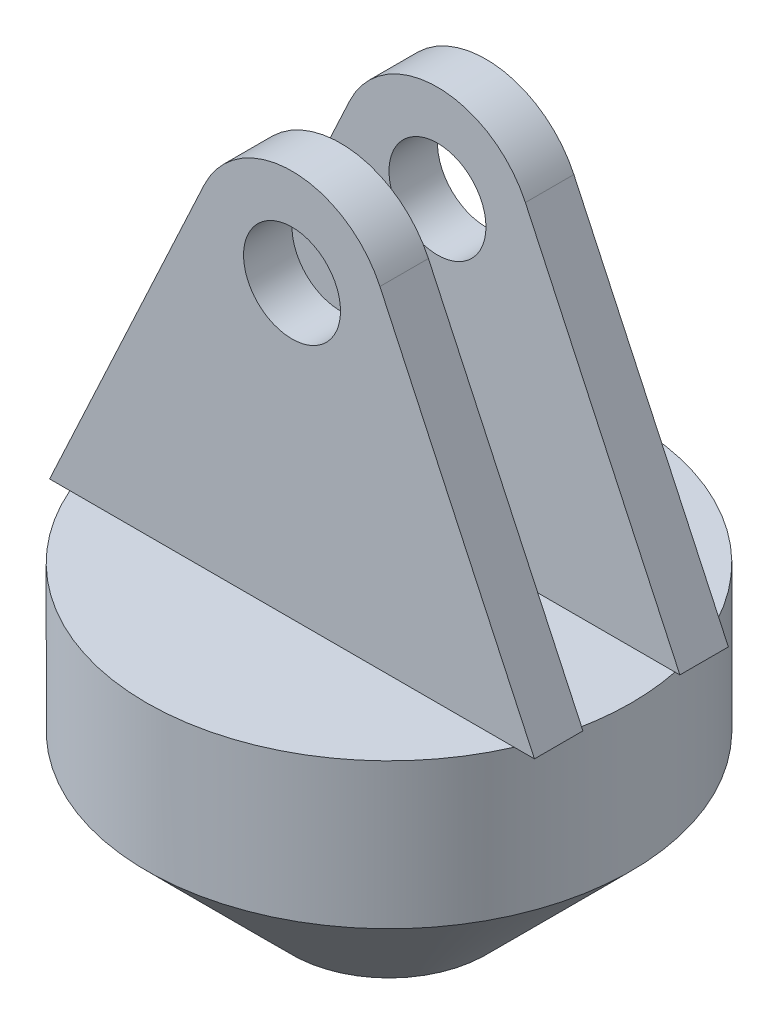
ISO-10303-21;
HEADER;
FILE_DESCRIPTION(('STEP AP214'),'2;1');
FILE_NAME('part.step','',(''),(''),'','','');
FILE_SCHEMA(('AUTOMOTIVE_DESIGN { 1 0 10303 214 1 1 1 1 }'));
ENDSEC;
DATA;
#1=APPLICATION_CONTEXT('core data for automotive mechanical design processes');
#2=APPLICATION_PROTOCOL_DEFINITION('international standard','automotive_design',2000,#1);
#3=PRODUCT_CONTEXT('',#1,'mechanical');
#4=PRODUCT('Part','Part','',(#3));
#5=PRODUCT_RELATED_PRODUCT_CATEGORY('part','',(#4));
#6=PRODUCT_DEFINITION_FORMATION('','',#4);
#7=PRODUCT_DEFINITION_CONTEXT('part definition',#1,'design');
#8=PRODUCT_DEFINITION('design','',#6,#7);
#9=PRODUCT_DEFINITION_SHAPE('','',#8);
#10=(LENGTH_UNIT() NAMED_UNIT(*) SI_UNIT(.MILLI.,.METRE.));
#11=(NAMED_UNIT(*) PLANE_ANGLE_UNIT() SI_UNIT($,.RADIAN.));
#12=(NAMED_UNIT(*) SI_UNIT($,.STERADIAN.) SOLID_ANGLE_UNIT());
#13=UNCERTAINTY_MEASURE_WITH_UNIT(LENGTH_MEASURE(1.E-05),#10,'distance_accuracy_value','');
#14=(GEOMETRIC_REPRESENTATION_CONTEXT(3) GLOBAL_UNCERTAINTY_ASSIGNED_CONTEXT((#13)) GLOBAL_UNIT_ASSIGNED_CONTEXT((#10,
#11,#12)) REPRESENTATION_CONTEXT('',''));
#15=CARTESIAN_POINT('',(0.,0.,0.));
#16=DIRECTION('',(0.,0.,1.));
#17=DIRECTION('',(1.,0.,0.));
#18=AXIS2_PLACEMENT_3D('',#15,#16,#17);
#19=CARTESIAN_POINT('',(50.,60.,0.));
#20=DIRECTION('',(0.,1.,0.));
#21=DIRECTION('',(0.,0.,1.));
#22=AXIS2_PLACEMENT_3D('',#19,#20,#21);
#23=PLANE('',#22);
#24=CARTESIAN_POINT('',(0.,60.,0.));
#25=DIRECTION('',(0.,-1.,0.));
#26=DIRECTION('',(0.,0.,-1.));
#27=AXIS2_PLACEMENT_3D('',#24,#25,#26);
#28=CIRCLE('',#27,50.);
#29=CARTESIAN_POINT('',(48.9897948556636,60.,-10.));
#30=VERTEX_POINT('',#29);
#31=CARTESIAN_POINT('',(48.9897948556636,60.,10.));
#32=VERTEX_POINT('',#31);
#33=EDGE_CURVE('E212',#30,#32,#28,.T.);
#34=ORIENTED_EDGE('',*,*,#33,.F.);
#35=DIRECTION('',(1.,0.,0.));
#36=VECTOR('',#35,1.);
#37=CARTESIAN_POINT('',(-50.,60.,-10.));
#38=LINE('',#37,#36);
#39=CARTESIAN_POINT('',(-48.9897948556636,60.,-10.));
#40=VERTEX_POINT('',#39);
#41=EDGE_CURVE('E54',#40,#30,#38,.T.);
#42=ORIENTED_EDGE('',*,*,#41,.F.);
#43=CARTESIAN_POINT('',(-48.9897948556636,60.,10.));
#44=VERTEX_POINT('',#43);
#45=EDGE_CURVE('E60',#44,#40,#28,.T.);
#46=ORIENTED_EDGE('',*,*,#45,.F.);
#47=DIRECTION('',(1.,0.,0.));
#48=VECTOR('',#47,1.);
#49=CARTESIAN_POINT('',(-50.,60.,10.));
#50=LINE('',#49,#48);
#51=EDGE_CURVE('E11',#44,#32,#50,.T.);
#52=ORIENTED_EDGE('',*,*,#51,.T.);
#53=EDGE_LOOP('',(#34,#42,#46,#52));
#54=FACE_BOUND('',#53,.T.);
#55=ADVANCED_FACE('F35',(#54),#23,.T.);
#56=DIRECTION('',(1.,0.,0.));
#57=VECTOR('',#56,1.);
#58=CARTESIAN_POINT('',(-50.,60.,-20.));
#59=LINE('',#58,#57);
#60=CARTESIAN_POINT('',(-45.8257569495584,60.,-20.));
#61=VERTEX_POINT('',#60);
#62=CARTESIAN_POINT('',(45.8257569495584,60.,-20.));
#63=VERTEX_POINT('',#62);
#64=EDGE_CURVE('E150',#61,#63,#59,.T.);
#65=ORIENTED_EDGE('',*,*,#64,.T.);
#66=EDGE_CURVE('E261',#61,#63,#28,.T.);
#67=ORIENTED_EDGE('',*,*,#66,.F.);
#68=EDGE_LOOP('',(#65,#67));
#69=FACE_BOUND('',#68,.T.);
#70=ADVANCED_FACE('F270',(#69),#23,.T.);
#71=CARTESIAN_POINT('',(0.,0.,0.));
#72=DIRECTION('',(0.,-1.,0.));
#73=DIRECTION('',(0.,0.,-1.));
#74=AXIS2_PLACEMENT_3D('',#71,#72,#73);
#75=PLANE('',#74);
#76=CARTESIAN_POINT('',(0.,0.,0.));
#77=DIRECTION('',(0.,-1.,0.));
#78=DIRECTION('',(0.,0.,-1.));
#79=AXIS2_PLACEMENT_3D('',#76,#77,#78);
#80=CIRCLE('',#79,20.);
#81=CARTESIAN_POINT('',(0.,0.,-20.));
#82=VERTEX_POINT('',#81);
#83=EDGE_CURVE('E39',#82,#82,#80,.T.);
#84=ORIENTED_EDGE('',*,*,#83,.T.);
#85=EDGE_LOOP('',(#84));
#86=FACE_BOUND('',#85,.T.);
#87=ADVANCED_FACE('F37',(#86),#75,.T.);
#88=CARTESIAN_POINT('',(0.,0.,0.));
#89=DIRECTION('',(0.,1.,0.));
#90=DIRECTION('',(0.,0.,1.));
#91=AXIS2_PLACEMENT_3D('',#88,#89,#90);
#92=CONICAL_SURFACE('',#91,20.,0.785398163397447);
#93=CARTESIAN_POINT('',(0.,30.0000000000001,0.));
#94=DIRECTION('',(0.,-1.,0.));
#95=DIRECTION('',(0.,0.,-1.));
#96=AXIS2_PLACEMENT_3D('',#93,#94,#95);
#97=CIRCLE('',#96,50.);
#98=CARTESIAN_POINT('',(0.,30.0000000000001,-50.));
#99=VERTEX_POINT('',#98);
#100=EDGE_CURVE('E214',#99,#99,#97,.T.);
#101=ORIENTED_EDGE('',*,*,#100,.T.);
#102=EDGE_LOOP('',(#101));
#103=FACE_BOUND('',#102,.T.);
#104=ORIENTED_EDGE('',*,*,#83,.F.);
#105=EDGE_LOOP('',(#104));
#106=FACE_BOUND('',#105,.T.);
#107=ADVANCED_FACE('F285',(#103,#106),#92,.T.);
#108=CARTESIAN_POINT('',(0.,0.,0.));
#109=DIRECTION('',(0.,-1.,0.));
#110=DIRECTION('',(0.,0.,-1.));
#111=AXIS2_PLACEMENT_3D('',#108,#109,#110);
#112=CYLINDRICAL_SURFACE('',#111,50.);
#113=CARTESIAN_POINT('',(45.8257569495584,60.,20.));
#114=VERTEX_POINT('',#113);
#115=EDGE_CURVE('E213',#32,#114,#28,.T.);
#116=ORIENTED_EDGE('',*,*,#115,.T.);
#117=CARTESIAN_POINT('',(-45.8257569495584,60.,20.));
#118=VERTEX_POINT('',#117);
#119=EDGE_CURVE('E215',#114,#118,#28,.T.);
#120=ORIENTED_EDGE('',*,*,#119,.T.);
#121=EDGE_CURVE('E256',#118,#44,#28,.T.);
#122=ORIENTED_EDGE('',*,*,#121,.T.);
#123=ORIENTED_EDGE('',*,*,#45,.T.);
#124=EDGE_CURVE('E259',#40,#61,#28,.T.);
#125=ORIENTED_EDGE('',*,*,#124,.T.);
#126=ORIENTED_EDGE('',*,*,#66,.T.);
#127=EDGE_CURVE('E263',#63,#30,#28,.T.);
#128=ORIENTED_EDGE('',*,*,#127,.T.);
#129=ORIENTED_EDGE('',*,*,#33,.T.);
#130=EDGE_LOOP('',(#116,#120,#122,#123,#125,#126,#128,#129));
#131=FACE_BOUND('',#130,.T.);
#132=ORIENTED_EDGE('',*,*,#100,.F.);
#133=EDGE_LOOP('',(#132));
#134=FACE_BOUND('',#133,.T.);
#135=ADVANCED_FACE('F266',(#131,#134),#112,.T.);
#136=DIRECTION('',(1.,0.,0.));
#137=VECTOR('',#136,1.);
#138=CARTESIAN_POINT('',(-50.,60.,20.));
#139=LINE('',#138,#137);
#140=EDGE_CURVE('E44',#118,#114,#139,.T.);
#141=ORIENTED_EDGE('',*,*,#140,.F.);
#142=ORIENTED_EDGE('',*,*,#119,.F.);
#143=EDGE_LOOP('',(#141,#142));
#144=FACE_BOUND('',#143,.T.);
#145=ADVANCED_FACE('F272',(#144),#23,.T.);
#146=CARTESIAN_POINT('',(-50.,60.,20.));
#147=DIRECTION('',(0.,1.,0.));
#148=DIRECTION('',(0.,0.,1.));
#149=AXIS2_PLACEMENT_3D('',#146,#147,#148);
#150=PLANE('',#149);
#151=ORIENTED_EDGE('',*,*,#115,.F.);
#152=CARTESIAN_POINT('',(50.,60.,10.));
#153=VERTEX_POINT('',#152);
#154=EDGE_CURVE('E47',#32,#153,#50,.T.);
#155=ORIENTED_EDGE('',*,*,#154,.T.);
#156=DIRECTION('',(0.,0.,-1.));
#157=VECTOR('',#156,1.);
#158=CARTESIAN_POINT('',(50.,60.,20.));
#159=LINE('',#158,#157);
#160=CARTESIAN_POINT('',(50.,60.,20.));
#161=VERTEX_POINT('',#160);
#162=EDGE_CURVE('E209',#161,#153,#159,.T.);
#163=ORIENTED_EDGE('',*,*,#162,.F.);
#164=EDGE_CURVE('E187',#114,#161,#139,.T.);
#165=ORIENTED_EDGE('',*,*,#164,.F.);
#166=EDGE_LOOP('',(#151,#155,#163,#165));
#167=FACE_BOUND('',#166,.T.);
#168=ADVANCED_FACE('F235',(#167),#150,.F.);
#169=CARTESIAN_POINT('',(0.,120.,20.));
#170=DIRECTION('',(0.,0.,1.));
#171=DIRECTION('',(1.,0.,0.));
#172=AXIS2_PLACEMENT_3D('',#169,#170,#171);
#173=PLANE('',#172);
#174=CARTESIAN_POINT('',(-50.,60.,20.));
#175=VERTEX_POINT('',#174);
#176=EDGE_CURVE('E183',#175,#118,#139,.T.);
#177=ORIENTED_EDGE('',*,*,#176,.T.);
#178=ORIENTED_EDGE('',*,*,#140,.T.);
#179=ORIENTED_EDGE('',*,*,#164,.T.);
#180=DIRECTION('',(-0.422117576661537,0.906541091993844,0.));
#181=VECTOR('',#180,1.);
#182=CARTESIAN_POINT('',(50.,60.,20.));
#183=LINE('',#182,#181);
#184=CARTESIAN_POINT('',(18.1308218398769,128.442351533231,20.));
#185=VERTEX_POINT('',#184);
#186=EDGE_CURVE('E186',#161,#185,#183,.T.);
#187=ORIENTED_EDGE('',*,*,#186,.T.);
#188=CARTESIAN_POINT('',(0.,120.,20.));
#189=DIRECTION('',(0.,0.,1.));
#190=DIRECTION('',(1.,0.,0.));
#191=AXIS2_PLACEMENT_3D('',#188,#189,#190);
#192=CIRCLE('',#191,20.);
#193=CARTESIAN_POINT('',(-18.1308218398769,128.442351533231,20.));
#194=VERTEX_POINT('',#193);
#195=EDGE_CURVE('E189',#185,#194,#192,.T.);
#196=ORIENTED_EDGE('',*,*,#195,.T.);
#197=DIRECTION('',(-0.422117576661537,-0.906541091993844,0.));
#198=VECTOR('',#197,1.);
#199=CARTESIAN_POINT('',(-50.,60.,20.));
#200=LINE('',#199,#198);
#201=EDGE_CURVE('E191',#194,#175,#200,.T.);
#202=ORIENTED_EDGE('',*,*,#201,.T.);
#203=EDGE_LOOP('',(#177,#178,#179,#187,#196,#202));
#204=FACE_BOUND('',#203,.T.);
#205=CARTESIAN_POINT('',(0.,120.,20.));
#206=DIRECTION('',(0.,0.,1.));
#207=DIRECTION('',(1.,0.,0.));
#208=AXIS2_PLACEMENT_3D('',#205,#206,#207);
#209=CIRCLE('',#208,10.);
#210=CARTESIAN_POINT('',(10.,120.,20.));
#211=VERTEX_POINT('',#210);
#212=EDGE_CURVE('E178',#211,#211,#209,.T.);
#213=ORIENTED_EDGE('',*,*,#212,.F.);
#214=EDGE_LOOP('',(#213));
#215=FACE_BOUND('',#214,.T.);
#216=ADVANCED_FACE('F226',(#204,#215),#173,.T.);
#217=CARTESIAN_POINT('',(0.,120.,10.));
#218=DIRECTION('',(0.,0.,1.));
#219=DIRECTION('',(1.,0.,0.));
#220=AXIS2_PLACEMENT_3D('',#217,#218,#219);
#221=PLANE('',#220);
#222=CARTESIAN_POINT('',(-50.,60.,10.));
#223=VERTEX_POINT('',#222);
#224=EDGE_CURVE('E46',#223,#44,#50,.T.);
#225=ORIENTED_EDGE('',*,*,#224,.F.);
#226=DIRECTION('',(-0.422117576661537,-0.906541091993844,0.));
#227=VECTOR('',#226,1.);
#228=CARTESIAN_POINT('',(-50.,60.,10.));
#229=LINE('',#228,#227);
#230=CARTESIAN_POINT('',(-18.1308218398769,128.442351533231,10.));
#231=VERTEX_POINT('',#230);
#232=EDGE_CURVE('E199',#231,#223,#229,.T.);
#233=ORIENTED_EDGE('',*,*,#232,.F.);
#234=CARTESIAN_POINT('',(0.,120.,10.));
#235=DIRECTION('',(0.,0.,1.));
#236=DIRECTION('',(1.,0.,0.));
#237=AXIS2_PLACEMENT_3D('',#234,#235,#236);
#238=CIRCLE('',#237,20.);
#239=CARTESIAN_POINT('',(18.1308218398769,128.442351533231,10.));
#240=VERTEX_POINT('',#239);
#241=EDGE_CURVE('E197',#240,#231,#238,.T.);
#242=ORIENTED_EDGE('',*,*,#241,.F.);
#243=DIRECTION('',(-0.422117576661537,0.906541091993844,0.));
#244=VECTOR('',#243,1.);
#245=CARTESIAN_POINT('',(50.,60.,10.));
#246=LINE('',#245,#244);
#247=EDGE_CURVE('E195',#153,#240,#246,.T.);
#248=ORIENTED_EDGE('',*,*,#247,.F.);
#249=ORIENTED_EDGE('',*,*,#154,.F.);
#250=ORIENTED_EDGE('',*,*,#51,.F.);
#251=EDGE_LOOP('',(#225,#233,#242,#248,#249,#250));
#252=FACE_BOUND('',#251,.T.);
#253=CARTESIAN_POINT('',(0.,120.,10.));
#254=DIRECTION('',(0.,0.,1.));
#255=DIRECTION('',(1.,0.,0.));
#256=AXIS2_PLACEMENT_3D('',#253,#254,#255);
#257=CIRCLE('',#256,10.);
#258=CARTESIAN_POINT('',(10.,120.,10.));
#259=VERTEX_POINT('',#258);
#260=EDGE_CURVE('E139',#259,#259,#257,.T.);
#261=ORIENTED_EDGE('',*,*,#260,.T.);
#262=EDGE_LOOP('',(#261));
#263=FACE_BOUND('',#262,.T.);
#264=ADVANCED_FACE('F242',(#252,#263),#221,.F.);
#265=ORIENTED_EDGE('',*,*,#121,.F.);
#266=ORIENTED_EDGE('',*,*,#176,.F.);
#267=DIRECTION('',(0.,0.,-1.));
#268=VECTOR('',#267,1.);
#269=CARTESIAN_POINT('',(-50.,60.,20.));
#270=LINE('',#269,#268);
#271=EDGE_CURVE('E192',#175,#223,#270,.T.);
#272=ORIENTED_EDGE('',*,*,#271,.T.);
#273=ORIENTED_EDGE('',*,*,#224,.T.);
#274=EDGE_LOOP('',(#265,#266,#272,#273));
#275=FACE_BOUND('',#274,.T.);
#276=ADVANCED_FACE('F255',(#275),#150,.F.);
#277=CARTESIAN_POINT('',(50.,60.,20.));
#278=DIRECTION('',(-0.906541091993844,-0.422117576661537,0.));
#279=DIRECTION('',(0.422117576661537,-0.906541091993844,0.));
#280=AXIS2_PLACEMENT_3D('',#277,#278,#279);
#281=PLANE('',#280);
#282=ORIENTED_EDGE('',*,*,#247,.T.);
#283=DIRECTION('',(0.,0.,-1.));
#284=VECTOR('',#283,1.);
#285=CARTESIAN_POINT('',(18.1308218398769,128.442351533231,20.));
#286=LINE('',#285,#284);
#287=EDGE_CURVE('E206',#185,#240,#286,.T.);
#288=ORIENTED_EDGE('',*,*,#287,.F.);
#289=ORIENTED_EDGE('',*,*,#186,.F.);
#290=ORIENTED_EDGE('',*,*,#162,.T.);
#291=EDGE_LOOP('',(#282,#288,#289,#290));
#292=FACE_BOUND('',#291,.T.);
#293=ADVANCED_FACE('F233',(#292),#281,.F.);
#294=CARTESIAN_POINT('',(0.,120.,20.));
#295=DIRECTION('',(0.,0.,-1.));
#296=DIRECTION('',(-1.,0.,0.));
#297=AXIS2_PLACEMENT_3D('',#294,#295,#296);
#298=CYLINDRICAL_SURFACE('',#297,20.);
#299=ORIENTED_EDGE('',*,*,#241,.T.);
#300=DIRECTION('',(0.,0.,-1.));
#301=VECTOR('',#300,1.);
#302=CARTESIAN_POINT('',(-18.1308218398769,128.442351533231,20.));
#303=LINE('',#302,#301);
#304=EDGE_CURVE('E203',#194,#231,#303,.T.);
#305=ORIENTED_EDGE('',*,*,#304,.F.);
#306=ORIENTED_EDGE('',*,*,#195,.F.);
#307=ORIENTED_EDGE('',*,*,#287,.T.);
#308=EDGE_LOOP('',(#299,#305,#306,#307));
#309=FACE_BOUND('',#308,.T.);
#310=ADVANCED_FACE('F246',(#309),#298,.T.);
#311=CARTESIAN_POINT('',(-50.,60.,20.));
#312=DIRECTION('',(0.906541091993844,-0.422117576661537,0.));
#313=DIRECTION('',(0.422117576661537,0.906541091993844,0.));
#314=AXIS2_PLACEMENT_3D('',#311,#312,#313);
#315=PLANE('',#314);
#316=ORIENTED_EDGE('',*,*,#232,.T.);
#317=ORIENTED_EDGE('',*,*,#271,.F.);
#318=ORIENTED_EDGE('',*,*,#201,.F.);
#319=ORIENTED_EDGE('',*,*,#304,.T.);
#320=EDGE_LOOP('',(#316,#317,#318,#319));
#321=FACE_BOUND('',#320,.T.);
#322=ADVANCED_FACE('F252',(#321),#315,.F.);
#323=CARTESIAN_POINT('',(0.,120.,20.));
#324=DIRECTION('',(0.,0.,-1.));
#325=DIRECTION('',(-1.,0.,0.));
#326=AXIS2_PLACEMENT_3D('',#323,#324,#325);
#327=CYLINDRICAL_SURFACE('',#326,10.);
#328=ORIENTED_EDGE('',*,*,#212,.T.);
#329=EDGE_LOOP('',(#328));
#330=FACE_BOUND('',#329,.T.);
#331=ORIENTED_EDGE('',*,*,#260,.F.);
#332=EDGE_LOOP('',(#331));
#333=FACE_BOUND('',#332,.T.);
#334=ADVANCED_FACE('F319',(#330,#333),#327,.F.);
#335=CARTESIAN_POINT('',(-50.,60.,-20.));
#336=DIRECTION('',(0.,-1.,0.));
#337=DIRECTION('',(0.,0.,-1.));
#338=AXIS2_PLACEMENT_3D('',#335,#336,#337);
#339=PLANE('',#338);
#340=CARTESIAN_POINT('',(-50.,60.,-20.));
#341=VERTEX_POINT('',#340);
#342=EDGE_CURVE('E132',#341,#61,#59,.T.);
#343=ORIENTED_EDGE('',*,*,#342,.T.);
#344=ORIENTED_EDGE('',*,*,#124,.F.);
#345=CARTESIAN_POINT('',(-50.,60.,-10.));
#346=VERTEX_POINT('',#345);
#347=EDGE_CURVE('E134',#346,#40,#38,.T.);
#348=ORIENTED_EDGE('',*,*,#347,.F.);
#349=DIRECTION('',(0.,0.,1.));
#350=VECTOR('',#349,1.);
#351=CARTESIAN_POINT('',(-50.,60.,-20.));
#352=LINE('',#351,#350);
#353=EDGE_CURVE('E129',#341,#346,#352,.T.);
#354=ORIENTED_EDGE('',*,*,#353,.F.);
#355=EDGE_LOOP('',(#343,#344,#348,#354));
#356=FACE_BOUND('',#355,.T.);
#357=ADVANCED_FACE('F131',(#356),#339,.T.);
#358=CARTESIAN_POINT('',(50.,60.,-10.));
#359=VERTEX_POINT('',#358);
#360=EDGE_CURVE('E165',#30,#359,#38,.T.);
#361=ORIENTED_EDGE('',*,*,#360,.F.);
#362=ORIENTED_EDGE('',*,*,#127,.F.);
#363=CARTESIAN_POINT('',(50.,60.,-20.));
#364=VERTEX_POINT('',#363);
#365=EDGE_CURVE('E152',#63,#364,#59,.T.);
#366=ORIENTED_EDGE('',*,*,#365,.T.);
#367=DIRECTION('',(0.,0.,1.));
#368=VECTOR('',#367,1.);
#369=CARTESIAN_POINT('',(50.,60.,-20.));
#370=LINE('',#369,#368);
#371=EDGE_CURVE('E162',#364,#359,#370,.T.);
#372=ORIENTED_EDGE('',*,*,#371,.T.);
#373=EDGE_LOOP('',(#361,#362,#366,#372));
#374=FACE_BOUND('',#373,.T.);
#375=ADVANCED_FACE('F318',(#374),#339,.T.);
#376=CARTESIAN_POINT('',(-50.,60.,-20.));
#377=DIRECTION('',(-0.906541091993844,0.422117576661537,0.));
#378=DIRECTION('',(-0.422117576661537,-0.906541091993844,0.));
#379=AXIS2_PLACEMENT_3D('',#376,#377,#378);
#380=PLANE('',#379);
#381=DIRECTION('',(-0.422117576661537,-0.906541091993844,0.));
#382=VECTOR('',#381,1.);
#383=CARTESIAN_POINT('',(-50.,60.,-10.));
#384=LINE('',#383,#382);
#385=CARTESIAN_POINT('',(-18.1308218398769,128.442351533231,-10.));
#386=VERTEX_POINT('',#385);
#387=EDGE_CURVE('E164',#386,#346,#384,.T.);
#388=ORIENTED_EDGE('',*,*,#387,.F.);
#389=DIRECTION('',(0.,0.,1.));
#390=VECTOR('',#389,1.);
#391=CARTESIAN_POINT('',(-18.1308218398769,128.442351533231,-20.));
#392=LINE('',#391,#390);
#393=CARTESIAN_POINT('',(-18.1308218398769,128.442351533231,-20.));
#394=VERTEX_POINT('',#393);
#395=EDGE_CURVE('E140',#394,#386,#392,.T.);
#396=ORIENTED_EDGE('',*,*,#395,.F.);
#397=DIRECTION('',(-0.422117576661537,-0.906541091993844,0.));
#398=VECTOR('',#397,1.);
#399=CARTESIAN_POINT('',(-50.,60.,-20.));
#400=LINE('',#399,#398);
#401=EDGE_CURVE('E146',#394,#341,#400,.T.);
#402=ORIENTED_EDGE('',*,*,#401,.T.);
#403=ORIENTED_EDGE('',*,*,#353,.T.);
#404=EDGE_LOOP('',(#388,#396,#402,#403));
#405=FACE_BOUND('',#404,.T.);
#406=ADVANCED_FACE('F153',(#405),#380,.T.);
#407=CARTESIAN_POINT('',(0.,120.,-20.));
#408=DIRECTION('',(0.,0.,1.));
#409=DIRECTION('',(1.,0.,0.));
#410=AXIS2_PLACEMENT_3D('',#407,#408,#409);
#411=CYLINDRICAL_SURFACE('',#410,20.);
#412=CARTESIAN_POINT('',(0.,120.,-10.));
#413=DIRECTION('',(0.,0.,1.));
#414=DIRECTION('',(1.,0.,0.));
#415=AXIS2_PLACEMENT_3D('',#412,#413,#414);
#416=CIRCLE('',#415,20.);
#417=CARTESIAN_POINT('',(18.1308218398769,128.442351533231,-10.));
#418=VERTEX_POINT('',#417);
#419=EDGE_CURVE('E167',#418,#386,#416,.T.);
#420=ORIENTED_EDGE('',*,*,#419,.F.);
#421=DIRECTION('',(0.,0.,1.));
#422=VECTOR('',#421,1.);
#423=CARTESIAN_POINT('',(18.1308218398769,128.442351533231,-20.));
#424=LINE('',#423,#422);
#425=CARTESIAN_POINT('',(18.1308218398769,128.442351533231,-20.));
#426=VERTEX_POINT('',#425);
#427=EDGE_CURVE('E175',#426,#418,#424,.T.);
#428=ORIENTED_EDGE('',*,*,#427,.F.);
#429=CARTESIAN_POINT('',(0.,120.,-20.));
#430=DIRECTION('',(0.,0.,1.));
#431=DIRECTION('',(1.,0.,0.));
#432=AXIS2_PLACEMENT_3D('',#429,#430,#431);
#433=CIRCLE('',#432,20.);
#434=EDGE_CURVE('E154',#426,#394,#433,.T.);
#435=ORIENTED_EDGE('',*,*,#434,.T.);
#436=ORIENTED_EDGE('',*,*,#395,.T.);
#437=EDGE_LOOP('',(#420,#428,#435,#436));
#438=FACE_BOUND('',#437,.T.);
#439=ADVANCED_FACE('F337',(#438),#411,.T.);
#440=CARTESIAN_POINT('',(50.,60.,-20.));
#441=DIRECTION('',(0.906541091993844,0.422117576661537,0.));
#442=DIRECTION('',(-0.422117576661537,0.906541091993844,0.));
#443=AXIS2_PLACEMENT_3D('',#440,#441,#442);
#444=PLANE('',#443);
#445=DIRECTION('',(-0.422117576661537,0.906541091993844,0.));
#446=VECTOR('',#445,1.);
#447=CARTESIAN_POINT('',(50.,60.,-10.));
#448=LINE('',#447,#446);
#449=EDGE_CURVE('E170',#359,#418,#448,.T.);
#450=ORIENTED_EDGE('',*,*,#449,.F.);
#451=ORIENTED_EDGE('',*,*,#371,.F.);
#452=DIRECTION('',(-0.422117576661537,0.906541091993844,0.));
#453=VECTOR('',#452,1.);
#454=CARTESIAN_POINT('',(50.,60.,-20.));
#455=LINE('',#454,#453);
#456=EDGE_CURVE('E156',#364,#426,#455,.T.);
#457=ORIENTED_EDGE('',*,*,#456,.T.);
#458=ORIENTED_EDGE('',*,*,#427,.T.);
#459=EDGE_LOOP('',(#450,#451,#457,#458));
#460=FACE_BOUND('',#459,.T.);
#461=ADVANCED_FACE('F346',(#460),#444,.T.);
#462=CARTESIAN_POINT('',(0.,120.,-20.));
#463=DIRECTION('',(0.,0.,-1.));
#464=DIRECTION('',(1.,0.,0.));
#465=AXIS2_PLACEMENT_3D('',#462,#463,#464);
#466=PLANE('',#465);
#467=CARTESIAN_POINT('',(0.,120.,-20.));
#468=DIRECTION('',(0.,0.,1.));
#469=DIRECTION('',(1.,0.,0.));
#470=AXIS2_PLACEMENT_3D('',#467,#468,#469);
#471=CIRCLE('',#470,10.);
#472=CARTESIAN_POINT('',(10.,120.,-20.));
#473=VERTEX_POINT('',#472);
#474=EDGE_CURVE('E464',#473,#473,#471,.T.);
#475=ORIENTED_EDGE('',*,*,#474,.T.);
#476=EDGE_LOOP('',(#475));
#477=FACE_BOUND('',#476,.T.);
#478=ORIENTED_EDGE('',*,*,#342,.F.);
#479=ORIENTED_EDGE('',*,*,#401,.F.);
#480=ORIENTED_EDGE('',*,*,#434,.F.);
#481=ORIENTED_EDGE('',*,*,#456,.F.);
#482=ORIENTED_EDGE('',*,*,#365,.F.);
#483=ORIENTED_EDGE('',*,*,#64,.F.);
#484=EDGE_LOOP('',(#478,#479,#480,#481,#482,#483));
#485=FACE_BOUND('',#484,.T.);
#486=ADVANCED_FACE('F144',(#477,#485),#466,.T.);
#487=CARTESIAN_POINT('',(0.,120.,-10.));
#488=DIRECTION('',(0.,0.,-1.));
#489=DIRECTION('',(1.,0.,0.));
#490=AXIS2_PLACEMENT_3D('',#487,#488,#489);
#491=PLANE('',#490);
#492=CARTESIAN_POINT('',(0.,120.,-10.));
#493=DIRECTION('',(0.,0.,1.));
#494=DIRECTION('',(1.,0.,0.));
#495=AXIS2_PLACEMENT_3D('',#492,#493,#494);
#496=CIRCLE('',#495,10.);
#497=CARTESIAN_POINT('',(10.,120.,-10.));
#498=VERTEX_POINT('',#497);
#499=EDGE_CURVE('E467',#498,#498,#496,.T.);
#500=ORIENTED_EDGE('',*,*,#499,.F.);
#501=EDGE_LOOP('',(#500));
#502=FACE_BOUND('',#501,.T.);
#503=ORIENTED_EDGE('',*,*,#347,.T.);
#504=ORIENTED_EDGE('',*,*,#41,.T.);
#505=ORIENTED_EDGE('',*,*,#360,.T.);
#506=ORIENTED_EDGE('',*,*,#449,.T.);
#507=ORIENTED_EDGE('',*,*,#419,.T.);
#508=ORIENTED_EDGE('',*,*,#387,.T.);
#509=EDGE_LOOP('',(#503,#504,#505,#506,#507,#508));
#510=FACE_BOUND('',#509,.T.);
#511=ADVANCED_FACE('F365',(#502,#510),#491,.F.);
#512=CARTESIAN_POINT('',(0.,120.,-20.));
#513=DIRECTION('',(0.,0.,1.));
#514=DIRECTION('',(1.,0.,0.));
#515=AXIS2_PLACEMENT_3D('',#512,#513,#514);
#516=CYLINDRICAL_SURFACE('',#515,10.);
#517=ORIENTED_EDGE('',*,*,#474,.F.);
#518=EDGE_LOOP('',(#517));
#519=FACE_BOUND('',#518,.T.);
#520=ORIENTED_EDGE('',*,*,#499,.T.);
#521=EDGE_LOOP('',(#520));
#522=FACE_BOUND('',#521,.T.);
#523=ADVANCED_FACE('F375',(#519,#522),#516,.F.);
#524=CLOSED_SHELL('',(#55,#70,#87,#107,#135,#145,#168,#216,#264,#276,#293,#310,#322,#334,#357,
#375,#406,#439,#461,#486,#511,#523));
#525=MANIFOLD_SOLID_BREP('B2',#524);
#526=ADVANCED_BREP_SHAPE_REPRESENTATION('',(#18,#525),#14);
#527=SHAPE_DEFINITION_REPRESENTATION(#9,#526);
ENDSEC;
END-ISO-10303-21;
